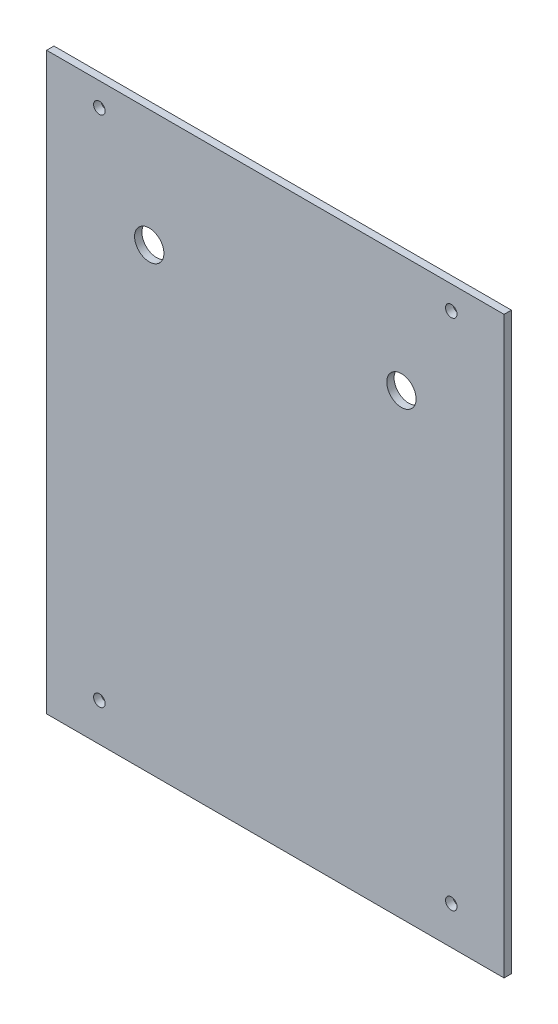
ISO-10303-21;
HEADER;
FILE_DESCRIPTION(('STEP AP214'),'2;1');
FILE_NAME('part.step','',(''),(''),'','','');
FILE_SCHEMA(('AUTOMOTIVE_DESIGN { 1 0 10303 214 1 1 1 1 }'));
ENDSEC;
DATA;
#1=APPLICATION_CONTEXT('core data for automotive mechanical design processes');
#2=APPLICATION_PROTOCOL_DEFINITION('international standard','automotive_design',2000,#1);
#3=PRODUCT_CONTEXT('',#1,'mechanical');
#4=PRODUCT('Part','Part','',(#3));
#5=PRODUCT_RELATED_PRODUCT_CATEGORY('part','',(#4));
#6=PRODUCT_DEFINITION_FORMATION('','',#4);
#7=PRODUCT_DEFINITION_CONTEXT('part definition',#1,'design');
#8=PRODUCT_DEFINITION('design','',#6,#7);
#9=PRODUCT_DEFINITION_SHAPE('','',#8);
#10=(LENGTH_UNIT() NAMED_UNIT(*) SI_UNIT(.MILLI.,.METRE.));
#11=(NAMED_UNIT(*) PLANE_ANGLE_UNIT() SI_UNIT($,.RADIAN.));
#12=(NAMED_UNIT(*) SI_UNIT($,.STERADIAN.) SOLID_ANGLE_UNIT());
#13=UNCERTAINTY_MEASURE_WITH_UNIT(LENGTH_MEASURE(1.E-05),#10,'distance_accuracy_value','');
#14=(GEOMETRIC_REPRESENTATION_CONTEXT(3) GLOBAL_UNCERTAINTY_ASSIGNED_CONTEXT((#13)) GLOBAL_UNIT_ASSIGNED_CONTEXT((#10,
#11,#12)) REPRESENTATION_CONTEXT('',''));
#15=CARTESIAN_POINT('',(0.,0.,0.));
#16=DIRECTION('',(0.,0.,1.));
#17=DIRECTION('',(1.,0.,0.));
#18=AXIS2_PLACEMENT_3D('',#15,#16,#17);
#19=CARTESIAN_POINT('',(0.,0.,3.175));
#20=DIRECTION('',(0.,0.,-1.));
#21=DIRECTION('',(-1.,0.,0.));
#22=AXIS2_PLACEMENT_3D('',#19,#20,#21);
#23=PLANE('',#22);
#24=CARTESIAN_POINT('',(54.6099999999999,-78.74,3.175));
#25=DIRECTION('',(0.,0.,1.));
#26=DIRECTION('',(-1.,0.,0.));
#27=AXIS2_PLACEMENT_3D('',#24,#25,#26);
#28=CIRCLE('',#27,6.35000000000001);
#29=CARTESIAN_POINT('',(48.2599999999999,-78.74,3.175));
#30=VERTEX_POINT('',#29);
#31=EDGE_CURVE('E171',#30,#30,#28,.T.);
#32=ORIENTED_EDGE('',*,*,#31,.F.);
#33=EDGE_LOOP('',(#32));
#34=FACE_BOUND('',#33,.T.);
#35=CARTESIAN_POINT('',(-54.61,-78.7399999999998,3.175));
#36=DIRECTION('',(0.,0.,1.));
#37=DIRECTION('',(1.,0.,0.));
#38=AXIS2_PLACEMENT_3D('',#35,#36,#37);
#39=CIRCLE('',#38,6.35);
#40=CARTESIAN_POINT('',(-48.26,-78.7399999999998,3.175));
#41=VERTEX_POINT('',#40);
#42=EDGE_CURVE('E163',#41,#41,#39,.T.);
#43=ORIENTED_EDGE('',*,*,#42,.F.);
#44=EDGE_LOOP('',(#43));
#45=FACE_BOUND('',#44,.T.);
#46=DIRECTION('',(0.,1.,0.));
#47=VECTOR('',#46,1.);
#48=CARTESIAN_POINT('',(99.06,-27.9399999999998,3.175));
#49=LINE('',#48,#47);
#50=CARTESIAN_POINT('',(99.06,-276.86,3.175));
#51=VERTEX_POINT('',#50);
#52=CARTESIAN_POINT('',(99.06,-27.9399999999998,3.175));
#53=VERTEX_POINT('',#52);
#54=EDGE_CURVE('E95',#51,#53,#49,.T.);
#55=ORIENTED_EDGE('',*,*,#54,.T.);
#56=DIRECTION('',(-1.,0.,0.));
#57=VECTOR('',#56,1.);
#58=CARTESIAN_POINT('',(99.06,-27.9399999999998,3.175));
#59=LINE('',#58,#57);
#60=CARTESIAN_POINT('',(-99.06,-27.9399999999998,3.175));
#61=VERTEX_POINT('',#60);
#62=EDGE_CURVE('E90',#53,#61,#59,.T.);
#63=ORIENTED_EDGE('',*,*,#62,.T.);
#64=DIRECTION('',(0.,-1.,0.));
#65=VECTOR('',#64,1.);
#66=CARTESIAN_POINT('',(-99.06,-276.86,3.175));
#67=LINE('',#66,#65);
#68=CARTESIAN_POINT('',(-99.06,-276.86,3.175));
#69=VERTEX_POINT('',#68);
#70=EDGE_CURVE('E93',#61,#69,#67,.T.);
#71=ORIENTED_EDGE('',*,*,#70,.T.);
#72=DIRECTION('',(1.,0.,0.));
#73=VECTOR('',#72,1.);
#74=CARTESIAN_POINT('',(99.06,-276.86,3.175));
#75=LINE('',#74,#73);
#76=EDGE_CURVE('E56',#69,#51,#75,.T.);
#77=ORIENTED_EDGE('',*,*,#76,.T.);
#78=EDGE_LOOP('',(#55,#63,#71,#77));
#79=FACE_BOUND('',#78,.T.);
#80=CARTESIAN_POINT('',(-76.2,-260.35,3.175));
#81=DIRECTION('',(0.,0.,1.));
#82=DIRECTION('',(1.,0.,0.));
#83=AXIS2_PLACEMENT_3D('',#80,#81,#82);
#84=CIRCLE('',#83,2.5);
#85=CARTESIAN_POINT('',(-73.7,-260.35,3.175));
#86=VERTEX_POINT('',#85);
#87=EDGE_CURVE('E117',#86,#86,#84,.T.);
#88=ORIENTED_EDGE('',*,*,#87,.F.);
#89=EDGE_LOOP('',(#88));
#90=FACE_BOUND('',#89,.T.);
#91=CARTESIAN_POINT('',(-76.2000000000001,-38.1000000000002,3.175));
#92=DIRECTION('',(0.,0.,1.));
#93=DIRECTION('',(1.,0.,0.));
#94=AXIS2_PLACEMENT_3D('',#91,#92,#93);
#95=CIRCLE('',#94,2.50000000000001);
#96=CARTESIAN_POINT('',(-73.7000000000001,-38.1000000000002,3.175));
#97=VERTEX_POINT('',#96);
#98=EDGE_CURVE('E139',#97,#97,#95,.T.);
#99=ORIENTED_EDGE('',*,*,#98,.F.);
#100=EDGE_LOOP('',(#99));
#101=FACE_BOUND('',#100,.T.);
#102=CARTESIAN_POINT('',(76.2,-38.1,3.175));
#103=DIRECTION('',(0.,0.,1.));
#104=DIRECTION('',(1.,0.,0.));
#105=AXIS2_PLACEMENT_3D('',#102,#103,#104);
#106=CIRCLE('',#105,2.5);
#107=CARTESIAN_POINT('',(78.7,-38.1,3.175));
#108=VERTEX_POINT('',#107);
#109=EDGE_CURVE('E146',#108,#108,#106,.T.);
#110=ORIENTED_EDGE('',*,*,#109,.F.);
#111=EDGE_LOOP('',(#110));
#112=FACE_BOUND('',#111,.T.);
#113=CARTESIAN_POINT('',(76.2000000000019,-260.35,3.175));
#114=DIRECTION('',(0.,0.,1.));
#115=DIRECTION('',(1.,0.,0.));
#116=AXIS2_PLACEMENT_3D('',#113,#114,#115);
#117=CIRCLE('',#116,2.50000000000001);
#118=CARTESIAN_POINT('',(78.7000000000019,-260.35,3.175));
#119=VERTEX_POINT('',#118);
#120=EDGE_CURVE('E153',#119,#119,#117,.T.);
#121=ORIENTED_EDGE('',*,*,#120,.F.);
#122=EDGE_LOOP('',(#121));
#123=FACE_BOUND('',#122,.T.);
#124=ADVANCED_FACE('F39',(#34,#45,#79,#90,#101,#112,#123),#23,.F.);
#125=CARTESIAN_POINT('',(0.,0.,0.));
#126=DIRECTION('',(0.,0.,-1.));
#127=DIRECTION('',(-1.,0.,0.));
#128=AXIS2_PLACEMENT_3D('',#125,#126,#127);
#129=PLANE('',#128);
#130=CARTESIAN_POINT('',(54.6099999999999,-78.74,0.));
#131=DIRECTION('',(0.,0.,1.));
#132=DIRECTION('',(-1.,0.,0.));
#133=AXIS2_PLACEMENT_3D('',#130,#131,#132);
#134=CIRCLE('',#133,6.35000000000001);
#135=CARTESIAN_POINT('',(48.2599999999999,-78.74,0.));
#136=VERTEX_POINT('',#135);
#137=EDGE_CURVE('E167',#136,#136,#134,.T.);
#138=ORIENTED_EDGE('',*,*,#137,.T.);
#139=EDGE_LOOP('',(#138));
#140=FACE_BOUND('',#139,.T.);
#141=CARTESIAN_POINT('',(-54.61,-78.7399999999998,0.));
#142=DIRECTION('',(0.,0.,1.));
#143=DIRECTION('',(1.,0.,0.));
#144=AXIS2_PLACEMENT_3D('',#141,#142,#143);
#145=CIRCLE('',#144,6.35);
#146=CARTESIAN_POINT('',(-48.26,-78.7399999999998,0.));
#147=VERTEX_POINT('',#146);
#148=EDGE_CURVE('E160',#147,#147,#145,.T.);
#149=ORIENTED_EDGE('',*,*,#148,.T.);
#150=EDGE_LOOP('',(#149));
#151=FACE_BOUND('',#150,.T.);
#152=CARTESIAN_POINT('',(76.2,-38.1,0.));
#153=DIRECTION('',(0.,0.,1.));
#154=DIRECTION('',(1.,0.,0.));
#155=AXIS2_PLACEMENT_3D('',#152,#153,#154);
#156=CIRCLE('',#155,2.5);
#157=CARTESIAN_POINT('',(78.7,-38.1,0.));
#158=VERTEX_POINT('',#157);
#159=EDGE_CURVE('E149',#158,#158,#156,.T.);
#160=ORIENTED_EDGE('',*,*,#159,.T.);
#161=EDGE_LOOP('',(#160));
#162=FACE_BOUND('',#161,.T.);
#163=CARTESIAN_POINT('',(-76.2,-260.35,0.));
#164=DIRECTION('',(0.,0.,1.));
#165=DIRECTION('',(1.,0.,0.));
#166=AXIS2_PLACEMENT_3D('',#163,#164,#165);
#167=CIRCLE('',#166,2.5);
#168=CARTESIAN_POINT('',(-73.7,-260.35,0.));
#169=VERTEX_POINT('',#168);
#170=EDGE_CURVE('E136',#169,#169,#167,.T.);
#171=ORIENTED_EDGE('',*,*,#170,.T.);
#172=EDGE_LOOP('',(#171));
#173=FACE_BOUND('',#172,.T.);
#174=DIRECTION('',(0.,1.,0.));
#175=VECTOR('',#174,1.);
#176=CARTESIAN_POINT('',(99.06,-27.9399999999998,0.));
#177=LINE('',#176,#175);
#178=CARTESIAN_POINT('',(99.06,-276.86,0.));
#179=VERTEX_POINT('',#178);
#180=CARTESIAN_POINT('',(99.06,-27.9399999999998,0.));
#181=VERTEX_POINT('',#180);
#182=EDGE_CURVE('E113',#179,#181,#177,.T.);
#183=ORIENTED_EDGE('',*,*,#182,.F.);
#184=DIRECTION('',(1.,0.,0.));
#185=VECTOR('',#184,1.);
#186=CARTESIAN_POINT('',(99.06,-276.86,0.));
#187=LINE('',#186,#185);
#188=CARTESIAN_POINT('',(-99.06,-276.86,0.));
#189=VERTEX_POINT('',#188);
#190=EDGE_CURVE('E83',#189,#179,#187,.T.);
#191=ORIENTED_EDGE('',*,*,#190,.F.);
#192=DIRECTION('',(0.,-1.,0.));
#193=VECTOR('',#192,1.);
#194=CARTESIAN_POINT('',(-99.06,-276.86,0.));
#195=LINE('',#194,#193);
#196=CARTESIAN_POINT('',(-99.06,-27.9399999999998,0.));
#197=VERTEX_POINT('',#196);
#198=EDGE_CURVE('E77',#197,#189,#195,.T.);
#199=ORIENTED_EDGE('',*,*,#198,.F.);
#200=DIRECTION('',(-1.,0.,0.));
#201=VECTOR('',#200,1.);
#202=CARTESIAN_POINT('',(99.06,-27.9399999999998,0.));
#203=LINE('',#202,#201);
#204=EDGE_CURVE('E100',#181,#197,#203,.T.);
#205=ORIENTED_EDGE('',*,*,#204,.F.);
#206=EDGE_LOOP('',(#183,#191,#199,#205));
#207=FACE_BOUND('',#206,.T.);
#208=CARTESIAN_POINT('',(-76.2000000000001,-38.1000000000002,0.));
#209=DIRECTION('',(0.,0.,1.));
#210=DIRECTION('',(1.,0.,0.));
#211=AXIS2_PLACEMENT_3D('',#208,#209,#210);
#212=CIRCLE('',#211,2.50000000000001);
#213=CARTESIAN_POINT('',(-73.7000000000001,-38.1000000000002,0.));
#214=VERTEX_POINT('',#213);
#215=EDGE_CURVE('E142',#214,#214,#212,.T.);
#216=ORIENTED_EDGE('',*,*,#215,.T.);
#217=EDGE_LOOP('',(#216));
#218=FACE_BOUND('',#217,.T.);
#219=CARTESIAN_POINT('',(76.2000000000019,-260.35,0.));
#220=DIRECTION('',(0.,0.,1.));
#221=DIRECTION('',(1.,0.,0.));
#222=AXIS2_PLACEMENT_3D('',#219,#220,#221);
#223=CIRCLE('',#222,2.50000000000001);
#224=CARTESIAN_POINT('',(78.7000000000019,-260.35,0.));
#225=VERTEX_POINT('',#224);
#226=EDGE_CURVE('E157',#225,#225,#223,.T.);
#227=ORIENTED_EDGE('',*,*,#226,.T.);
#228=EDGE_LOOP('',(#227));
#229=FACE_BOUND('',#228,.T.);
#230=ADVANCED_FACE('F130',(#140,#151,#162,#173,#207,#218,#229),#129,.T.);
#231=CARTESIAN_POINT('',(99.06,-27.9399999999998,3.175));
#232=DIRECTION('',(-1.,0.,0.));
#233=DIRECTION('',(0.,0.,1.));
#234=AXIS2_PLACEMENT_3D('',#231,#232,#233);
#235=PLANE('',#234);
#236=ORIENTED_EDGE('',*,*,#182,.T.);
#237=DIRECTION('',(0.,0.,-1.));
#238=VECTOR('',#237,1.);
#239=CARTESIAN_POINT('',(99.06,-27.9399999999998,3.175));
#240=LINE('',#239,#238);
#241=EDGE_CURVE('E11',#53,#181,#240,.T.);
#242=ORIENTED_EDGE('',*,*,#241,.F.);
#243=ORIENTED_EDGE('',*,*,#54,.F.);
#244=DIRECTION('',(0.,0.,-1.));
#245=VECTOR('',#244,1.);
#246=CARTESIAN_POINT('',(99.06,-276.86,3.175));
#247=LINE('',#246,#245);
#248=EDGE_CURVE('E109',#51,#179,#247,.T.);
#249=ORIENTED_EDGE('',*,*,#248,.T.);
#250=EDGE_LOOP('',(#236,#242,#243,#249));
#251=FACE_BOUND('',#250,.T.);
#252=ADVANCED_FACE('F41',(#251),#235,.F.);
#253=CARTESIAN_POINT('',(99.06,-27.9399999999998,3.175));
#254=DIRECTION('',(0.,-1.,0.));
#255=DIRECTION('',(0.,0.,-1.));
#256=AXIS2_PLACEMENT_3D('',#253,#254,#255);
#257=PLANE('',#256);
#258=ORIENTED_EDGE('',*,*,#204,.T.);
#259=DIRECTION('',(0.,0.,-1.));
#260=VECTOR('',#259,1.);
#261=CARTESIAN_POINT('',(-99.06,-27.9399999999998,3.175));
#262=LINE('',#261,#260);
#263=EDGE_CURVE('E48',#61,#197,#262,.T.);
#264=ORIENTED_EDGE('',*,*,#263,.F.);
#265=ORIENTED_EDGE('',*,*,#62,.F.);
#266=ORIENTED_EDGE('',*,*,#241,.T.);
#267=EDGE_LOOP('',(#258,#264,#265,#266));
#268=FACE_BOUND('',#267,.T.);
#269=ADVANCED_FACE('F99',(#268),#257,.F.);
#270=CARTESIAN_POINT('',(-99.06,-276.86,3.175));
#271=DIRECTION('',(1.,0.,0.));
#272=DIRECTION('',(0.,0.,-1.));
#273=AXIS2_PLACEMENT_3D('',#270,#271,#272);
#274=PLANE('',#273);
#275=ORIENTED_EDGE('',*,*,#198,.T.);
#276=DIRECTION('',(0.,0.,-1.));
#277=VECTOR('',#276,1.);
#278=CARTESIAN_POINT('',(-99.06,-276.86,3.175));
#279=LINE('',#278,#277);
#280=EDGE_CURVE('E102',#69,#189,#279,.T.);
#281=ORIENTED_EDGE('',*,*,#280,.F.);
#282=ORIENTED_EDGE('',*,*,#70,.F.);
#283=ORIENTED_EDGE('',*,*,#263,.T.);
#284=EDGE_LOOP('',(#275,#281,#282,#283));
#285=FACE_BOUND('',#284,.T.);
#286=ADVANCED_FACE('F103',(#285),#274,.F.);
#287=CARTESIAN_POINT('',(99.06,-276.86,3.175));
#288=DIRECTION('',(0.,1.,0.));
#289=DIRECTION('',(-1.,0.,0.));
#290=AXIS2_PLACEMENT_3D('',#287,#288,#289);
#291=PLANE('',#290);
#292=ORIENTED_EDGE('',*,*,#190,.T.);
#293=ORIENTED_EDGE('',*,*,#248,.F.);
#294=ORIENTED_EDGE('',*,*,#76,.F.);
#295=ORIENTED_EDGE('',*,*,#280,.T.);
#296=EDGE_LOOP('',(#292,#293,#294,#295));
#297=FACE_BOUND('',#296,.T.);
#298=ADVANCED_FACE('F127',(#297),#291,.F.);
#299=CARTESIAN_POINT('',(-76.2,-260.35,3.175));
#300=DIRECTION('',(0.,0.,-1.));
#301=DIRECTION('',(-1.,0.,0.));
#302=AXIS2_PLACEMENT_3D('',#299,#300,#301);
#303=CYLINDRICAL_SURFACE('',#302,2.5);
#304=ORIENTED_EDGE('',*,*,#87,.T.);
#305=EDGE_LOOP('',(#304));
#306=FACE_BOUND('',#305,.T.);
#307=ORIENTED_EDGE('',*,*,#170,.F.);
#308=EDGE_LOOP('',(#307));
#309=FACE_BOUND('',#308,.T.);
#310=ADVANCED_FACE('F210',(#306,#309),#303,.F.);
#311=CARTESIAN_POINT('',(-76.2000000000001,-38.1000000000002,3.175));
#312=DIRECTION('',(0.,0.,-1.));
#313=DIRECTION('',(-1.,0.,0.));
#314=AXIS2_PLACEMENT_3D('',#311,#312,#313);
#315=CYLINDRICAL_SURFACE('',#314,2.50000000000001);
#316=ORIENTED_EDGE('',*,*,#98,.T.);
#317=EDGE_LOOP('',(#316));
#318=FACE_BOUND('',#317,.T.);
#319=ORIENTED_EDGE('',*,*,#215,.F.);
#320=EDGE_LOOP('',(#319));
#321=FACE_BOUND('',#320,.T.);
#322=ADVANCED_FACE('F206',(#318,#321),#315,.F.);
#323=CARTESIAN_POINT('',(76.2,-38.1,3.175));
#324=DIRECTION('',(0.,0.,-1.));
#325=DIRECTION('',(-1.,0.,0.));
#326=AXIS2_PLACEMENT_3D('',#323,#324,#325);
#327=CYLINDRICAL_SURFACE('',#326,2.5);
#328=ORIENTED_EDGE('',*,*,#109,.T.);
#329=EDGE_LOOP('',(#328));
#330=FACE_BOUND('',#329,.T.);
#331=ORIENTED_EDGE('',*,*,#159,.F.);
#332=EDGE_LOOP('',(#331));
#333=FACE_BOUND('',#332,.T.);
#334=ADVANCED_FACE('F199',(#330,#333),#327,.F.);
#335=CARTESIAN_POINT('',(76.2000000000019,-260.35,3.175));
#336=DIRECTION('',(0.,0.,-1.));
#337=DIRECTION('',(-1.,0.,0.));
#338=AXIS2_PLACEMENT_3D('',#335,#336,#337);
#339=CYLINDRICAL_SURFACE('',#338,2.50000000000001);
#340=ORIENTED_EDGE('',*,*,#120,.T.);
#341=EDGE_LOOP('',(#340));
#342=FACE_BOUND('',#341,.T.);
#343=ORIENTED_EDGE('',*,*,#226,.F.);
#344=EDGE_LOOP('',(#343));
#345=FACE_BOUND('',#344,.T.);
#346=ADVANCED_FACE('F193',(#342,#345),#339,.F.);
#347=CARTESIAN_POINT('',(-54.61,-78.7399999999998,0.));
#348=DIRECTION('',(0.,0.,1.));
#349=DIRECTION('',(1.,0.,0.));
#350=AXIS2_PLACEMENT_3D('',#347,#348,#349);
#351=CYLINDRICAL_SURFACE('',#350,6.35);
#352=ORIENTED_EDGE('',*,*,#148,.F.);
#353=EDGE_LOOP('',(#352));
#354=FACE_BOUND('',#353,.T.);
#355=ORIENTED_EDGE('',*,*,#42,.T.);
#356=EDGE_LOOP('',(#355));
#357=FACE_BOUND('',#356,.T.);
#358=ADVANCED_FACE('F183',(#354,#357),#351,.F.);
#359=CARTESIAN_POINT('',(54.6099999999999,-78.74,0.));
#360=DIRECTION('',(0.,0.,1.));
#361=DIRECTION('',(1.,0.,0.));
#362=AXIS2_PLACEMENT_3D('',#359,#360,#361);
#363=CYLINDRICAL_SURFACE('',#362,6.35000000000001);
#364=ORIENTED_EDGE('',*,*,#137,.F.);
#365=EDGE_LOOP('',(#364));
#366=FACE_BOUND('',#365,.T.);
#367=ORIENTED_EDGE('',*,*,#31,.T.);
#368=EDGE_LOOP('',(#367));
#369=FACE_BOUND('',#368,.T.);
#370=ADVANCED_FACE('F180',(#366,#369),#363,.F.);
#371=CLOSED_SHELL('',(#124,#230,#252,#269,#286,#298,#310,#322,#334,#346,#358,#370));
#372=MANIFOLD_SOLID_BREP('B2',#371);
#373=ADVANCED_BREP_SHAPE_REPRESENTATION('',(#18,#372),#14);
#374=SHAPE_DEFINITION_REPRESENTATION(#9,#373);
ENDSEC;
END-ISO-10303-21;
